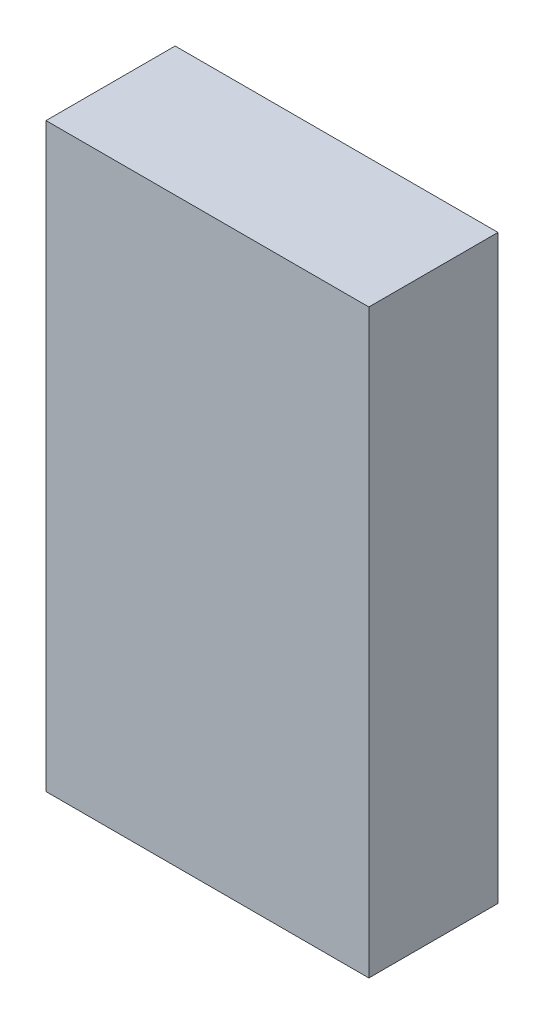
ISO-10303-21;
HEADER;
FILE_DESCRIPTION(('STEP AP214'),'2;1');
FILE_NAME('part.step','',(''),(''),'','','');
FILE_SCHEMA(('AUTOMOTIVE_DESIGN { 1 0 10303 214 1 1 1 1 }'));
ENDSEC;
DATA;
#1=APPLICATION_CONTEXT('core data for automotive mechanical design processes');
#2=APPLICATION_PROTOCOL_DEFINITION('international standard','automotive_design',2000,#1);
#3=PRODUCT_CONTEXT('',#1,'mechanical');
#4=PRODUCT('Part','Part','',(#3));
#5=PRODUCT_RELATED_PRODUCT_CATEGORY('part','',(#4));
#6=PRODUCT_DEFINITION_FORMATION('','',#4);
#7=PRODUCT_DEFINITION_CONTEXT('part definition',#1,'design');
#8=PRODUCT_DEFINITION('design','',#6,#7);
#9=PRODUCT_DEFINITION_SHAPE('','',#8);
#10=(LENGTH_UNIT() NAMED_UNIT(*) SI_UNIT(.MILLI.,.METRE.));
#11=(NAMED_UNIT(*) PLANE_ANGLE_UNIT() SI_UNIT($,.RADIAN.));
#12=(NAMED_UNIT(*) SI_UNIT($,.STERADIAN.) SOLID_ANGLE_UNIT());
#13=UNCERTAINTY_MEASURE_WITH_UNIT(LENGTH_MEASURE(1.E-05),#10,'distance_accuracy_value','');
#14=(GEOMETRIC_REPRESENTATION_CONTEXT(3) GLOBAL_UNCERTAINTY_ASSIGNED_CONTEXT((#13)) GLOBAL_UNIT_ASSIGNED_CONTEXT((#10,
#11,#12)) REPRESENTATION_CONTEXT('',''));
#15=CARTESIAN_POINT('',(0.,0.,0.));
#16=DIRECTION('',(0.,0.,1.));
#17=DIRECTION('',(1.,0.,0.));
#18=AXIS2_PLACEMENT_3D('',#15,#16,#17);
#19=CARTESIAN_POINT('',(-1.125,-2.05,0.));
#20=DIRECTION('',(1.,0.,0.));
#21=DIRECTION('',(0.,0.,1.));
#22=AXIS2_PLACEMENT_3D('',#19,#20,#21);
#23=PLANE('',#22);
#24=DIRECTION('',(0.,1.,0.));
#25=VECTOR('',#24,1.);
#26=CARTESIAN_POINT('',(-1.125,-2.05,0.1));
#27=LINE('',#26,#25);
#28=CARTESIAN_POINT('',(-1.125,-2.05,0.1));
#29=VERTEX_POINT('',#28);
#30=CARTESIAN_POINT('',(-1.125,-1.6,0.1));
#31=VERTEX_POINT('',#30);
#32=EDGE_CURVE('E11',#29,#31,#27,.T.);
#33=ORIENTED_EDGE('',*,*,#32,.T.);
#34=DIRECTION('',(0.,0.,1.));
#35=VECTOR('',#34,1.);
#36=CARTESIAN_POINT('',(-1.125,-1.6,0.));
#37=LINE('',#36,#35);
#38=CARTESIAN_POINT('',(-1.125,-1.6,0.));
#39=VERTEX_POINT('',#38);
#40=EDGE_CURVE('E24',#39,#31,#37,.T.);
#41=ORIENTED_EDGE('',*,*,#40,.F.);
#42=DIRECTION('',(0.,1.,0.));
#43=VECTOR('',#42,1.);
#44=CARTESIAN_POINT('',(-1.125,-2.05,0.));
#45=LINE('',#44,#43);
#46=CARTESIAN_POINT('',(-1.125,-2.05,0.));
#47=VERTEX_POINT('',#46);
#48=EDGE_CURVE('E86',#47,#39,#45,.T.);
#49=ORIENTED_EDGE('',*,*,#48,.F.);
#50=DIRECTION('',(0.,0.,1.));
#51=VECTOR('',#50,1.);
#52=CARTESIAN_POINT('',(-1.125,-2.05,0.));
#53=LINE('',#52,#51);
#54=EDGE_CURVE('E36',#47,#29,#53,.T.);
#55=ORIENTED_EDGE('',*,*,#54,.T.);
#56=EDGE_LOOP('',(#33,#41,#49,#55));
#57=FACE_BOUND('',#56,.T.);
#58=ADVANCED_FACE('F17',(#57),#23,.F.);
#59=CARTESIAN_POINT('',(-0.875,-2.05,0.));
#60=DIRECTION('',(1.,0.,0.));
#61=DIRECTION('',(0.,0.,1.));
#62=AXIS2_PLACEMENT_3D('',#59,#60,#61);
#63=PLANE('',#62);
#64=DIRECTION('',(0.,0.,1.));
#65=VECTOR('',#64,1.);
#66=CARTESIAN_POINT('',(-0.875,-2.05,0.));
#67=LINE('',#66,#65);
#68=CARTESIAN_POINT('',(-0.875,-2.05,0.));
#69=VERTEX_POINT('',#68);
#70=CARTESIAN_POINT('',(-0.875,-2.05,0.1));
#71=VERTEX_POINT('',#70);
#72=EDGE_CURVE('E83',#69,#71,#67,.T.);
#73=ORIENTED_EDGE('',*,*,#72,.F.);
#74=DIRECTION('',(0.,1.,0.));
#75=VECTOR('',#74,1.);
#76=CARTESIAN_POINT('',(-0.875,-2.05,0.));
#77=LINE('',#76,#75);
#78=CARTESIAN_POINT('',(-0.875,-1.6,0.));
#79=VERTEX_POINT('',#78);
#80=EDGE_CURVE('E63',#69,#79,#77,.T.);
#81=ORIENTED_EDGE('',*,*,#80,.T.);
#82=DIRECTION('',(0.,0.,1.));
#83=VECTOR('',#82,1.);
#84=CARTESIAN_POINT('',(-0.875,-1.6,0.));
#85=LINE('',#84,#83);
#86=CARTESIAN_POINT('',(-0.875,-1.6,0.1));
#87=VERTEX_POINT('',#86);
#88=EDGE_CURVE('E57',#79,#87,#85,.T.);
#89=ORIENTED_EDGE('',*,*,#88,.T.);
#90=DIRECTION('',(0.,1.,0.));
#91=VECTOR('',#90,1.);
#92=CARTESIAN_POINT('',(-0.875,-2.05,0.1));
#93=LINE('',#92,#91);
#94=EDGE_CURVE('E60',#71,#87,#93,.T.);
#95=ORIENTED_EDGE('',*,*,#94,.F.);
#96=EDGE_LOOP('',(#73,#81,#89,#95));
#97=FACE_BOUND('',#96,.T.);
#98=ADVANCED_FACE('F59',(#97),#63,.T.);
#99=CARTESIAN_POINT('',(-1.125,-2.05,0.));
#100=DIRECTION('',(0.,1.,0.));
#101=DIRECTION('',(0.,0.,1.));
#102=AXIS2_PLACEMENT_3D('',#99,#100,#101);
#103=PLANE('',#102);
#104=ORIENTED_EDGE('',*,*,#72,.T.);
#105=DIRECTION('',(1.,0.,0.));
#106=VECTOR('',#105,1.);
#107=CARTESIAN_POINT('',(-1.125,-2.05,0.1));
#108=LINE('',#107,#106);
#109=EDGE_CURVE('E71',#29,#71,#108,.T.);
#110=ORIENTED_EDGE('',*,*,#109,.F.);
#111=ORIENTED_EDGE('',*,*,#54,.F.);
#112=DIRECTION('',(1.,0.,0.));
#113=VECTOR('',#112,1.);
#114=CARTESIAN_POINT('',(-1.125,-2.05,0.));
#115=LINE('',#114,#113);
#116=EDGE_CURVE('E76',#47,#69,#115,.T.);
#117=ORIENTED_EDGE('',*,*,#116,.T.);
#118=EDGE_LOOP('',(#104,#110,#111,#117));
#119=FACE_BOUND('',#118,.T.);
#120=ADVANCED_FACE('F91',(#119),#103,.F.);
#121=CARTESIAN_POINT('',(-1.125,-1.6,0.));
#122=DIRECTION('',(0.,1.,0.));
#123=DIRECTION('',(0.,0.,1.));
#124=AXIS2_PLACEMENT_3D('',#121,#122,#123);
#125=PLANE('',#124);
#126=DIRECTION('',(1.,0.,0.));
#127=VECTOR('',#126,1.);
#128=CARTESIAN_POINT('',(-1.125,-1.6,0.));
#129=LINE('',#128,#127);
#130=EDGE_CURVE('E74',#39,#79,#129,.T.);
#131=ORIENTED_EDGE('',*,*,#130,.F.);
#132=ORIENTED_EDGE('',*,*,#40,.T.);
#133=DIRECTION('',(1.,0.,0.));
#134=VECTOR('',#133,1.);
#135=CARTESIAN_POINT('',(-1.125,-1.6,0.1));
#136=LINE('',#135,#134);
#137=EDGE_CURVE('E69',#31,#87,#136,.T.);
#138=ORIENTED_EDGE('',*,*,#137,.T.);
#139=ORIENTED_EDGE('',*,*,#88,.F.);
#140=EDGE_LOOP('',(#131,#132,#138,#139));
#141=FACE_BOUND('',#140,.T.);
#142=ADVANCED_FACE('F73',(#141),#125,.T.);
#143=CARTESIAN_POINT('',(-1.125,-2.05,0.));
#144=DIRECTION('',(0.,0.,1.));
#145=DIRECTION('',(1.,0.,0.));
#146=AXIS2_PLACEMENT_3D('',#143,#144,#145);
#147=PLANE('',#146);
#148=ORIENTED_EDGE('',*,*,#130,.T.);
#149=ORIENTED_EDGE('',*,*,#80,.F.);
#150=ORIENTED_EDGE('',*,*,#116,.F.);
#151=ORIENTED_EDGE('',*,*,#48,.T.);
#152=EDGE_LOOP('',(#148,#149,#150,#151));
#153=FACE_BOUND('',#152,.T.);
#154=ADVANCED_FACE('F89',(#153),#147,.F.);
#155=CARTESIAN_POINT('',(-1.125,-2.05,0.1));
#156=DIRECTION('',(0.,0.,1.));
#157=DIRECTION('',(1.,0.,0.));
#158=AXIS2_PLACEMENT_3D('',#155,#156,#157);
#159=PLANE('',#158);
#160=ORIENTED_EDGE('',*,*,#32,.F.);
#161=ORIENTED_EDGE('',*,*,#109,.T.);
#162=ORIENTED_EDGE('',*,*,#94,.T.);
#163=ORIENTED_EDGE('',*,*,#137,.F.);
#164=EDGE_LOOP('',(#160,#161,#162,#163));
#165=FACE_BOUND('',#164,.T.);
#166=ADVANCED_FACE('F68',(#165),#159,.T.);
#167=CLOSED_SHELL('',(#58,#98,#120,#142,#154,#166));
#168=MANIFOLD_SOLID_BREP('B1',#167);
#169=ADVANCED_BREP_SHAPE_REPRESENTATION('',(#18,#168),#14);
#170=SHAPE_DEFINITION_REPRESENTATION(#9,#169);
ENDSEC;
END-ISO-10303-21;
